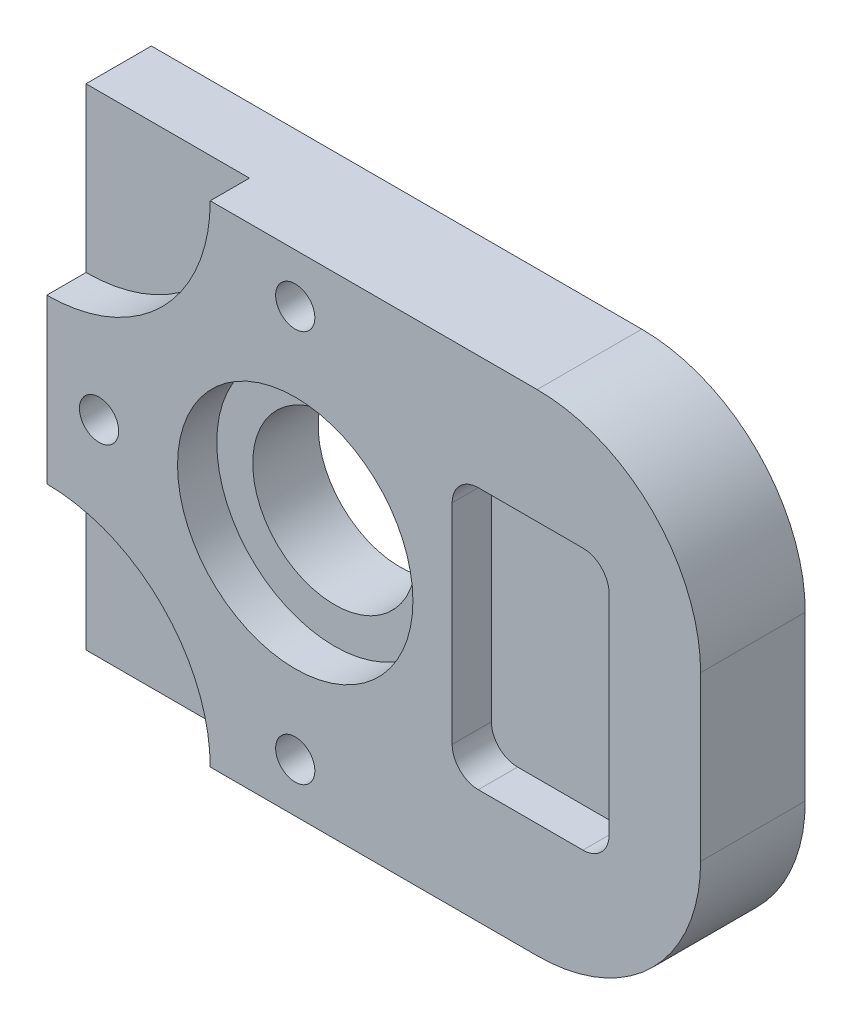
ISO-10303-21;
HEADER;
FILE_DESCRIPTION(('STEP AP214'),'2;1');
FILE_NAME('part.step','',(''),(''),'','','');
FILE_SCHEMA(('AUTOMOTIVE_DESIGN { 1 0 10303 214 1 1 1 1 }'));
ENDSEC;
DATA;
#1=APPLICATION_CONTEXT('core data for automotive mechanical design processes');
#2=APPLICATION_PROTOCOL_DEFINITION('international standard','automotive_design',2000,#1);
#3=PRODUCT_CONTEXT('',#1,'mechanical');
#4=PRODUCT('Part','Part','',(#3));
#5=PRODUCT_RELATED_PRODUCT_CATEGORY('part','',(#4));
#6=PRODUCT_DEFINITION_FORMATION('','',#4);
#7=PRODUCT_DEFINITION_CONTEXT('part definition',#1,'design');
#8=PRODUCT_DEFINITION('design','',#6,#7);
#9=PRODUCT_DEFINITION_SHAPE('','',#8);
#10=(LENGTH_UNIT() NAMED_UNIT(*) SI_UNIT(.MILLI.,.METRE.));
#11=(NAMED_UNIT(*) PLANE_ANGLE_UNIT() SI_UNIT($,.RADIAN.));
#12=(NAMED_UNIT(*) SI_UNIT($,.STERADIAN.) SOLID_ANGLE_UNIT());
#13=UNCERTAINTY_MEASURE_WITH_UNIT(LENGTH_MEASURE(1.E-05),#10,'distance_accuracy_value','');
#14=(GEOMETRIC_REPRESENTATION_CONTEXT(3) GLOBAL_UNCERTAINTY_ASSIGNED_CONTEXT((#13)) GLOBAL_UNIT_ASSIGNED_CONTEXT((#10,
#11,#12)) REPRESENTATION_CONTEXT('',''));
#15=CARTESIAN_POINT('',(0.,0.,0.));
#16=DIRECTION('',(0.,0.,1.));
#17=DIRECTION('',(1.,0.,0.));
#18=AXIS2_PLACEMENT_3D('',#15,#16,#17);
#19=CARTESIAN_POINT('',(38.,37.5,0.));
#20=DIRECTION('',(0.,0.,1.));
#21=DIRECTION('',(1.,0.,0.));
#22=AXIS2_PLACEMENT_3D('',#19,#20,#21);
#23=CYLINDRICAL_SURFACE('',#22,12.5);
#24=CARTESIAN_POINT('',(38.,37.5,0.));
#25=DIRECTION('',(0.,0.,1.));
#26=DIRECTION('',(1.,0.,0.));
#27=AXIS2_PLACEMENT_3D('',#24,#25,#26);
#28=CIRCLE('',#27,12.5);
#29=CARTESIAN_POINT('',(50.5,37.5,0.));
#30=VERTEX_POINT('',#29);
#31=EDGE_CURVE('E238',#30,#30,#28,.T.);
#32=ORIENTED_EDGE('',*,*,#31,.F.);
#33=EDGE_LOOP('',(#32));
#34=FACE_BOUND('',#33,.T.);
#35=CARTESIAN_POINT('',(38.,37.5,10.));
#36=DIRECTION('',(0.,0.,1.));
#37=DIRECTION('',(1.,0.,0.));
#38=AXIS2_PLACEMENT_3D('',#35,#36,#37);
#39=CIRCLE('',#38,12.5);
#40=CARTESIAN_POINT('',(50.5,37.5,10.));
#41=VERTEX_POINT('',#40);
#42=EDGE_CURVE('E237',#41,#41,#39,.F.);
#43=ORIENTED_EDGE('',*,*,#42,.F.);
#44=EDGE_LOOP('',(#43));
#45=FACE_BOUND('',#44,.T.);
#46=ADVANCED_FACE('F34',(#34,#45),#23,.F.);
#47=CARTESIAN_POINT('',(0.,75.,16.));
#48=DIRECTION('',(1.,0.,0.));
#49=DIRECTION('',(0.,0.,-1.));
#50=AXIS2_PLACEMENT_3D('',#47,#48,#49);
#51=PLANE('',#50);
#52=DIRECTION('',(0.,-1.,0.));
#53=VECTOR('',#52,1.);
#54=CARTESIAN_POINT('',(0.,75.,10.));
#55=LINE('',#54,#53);
#56=CARTESIAN_POINT('',(0.,25.,10.));
#57=VERTEX_POINT('',#56);
#58=CARTESIAN_POINT('',(0.,0.,10.));
#59=VERTEX_POINT('',#58);
#60=EDGE_CURVE('E163',#57,#59,#55,.T.);
#61=ORIENTED_EDGE('',*,*,#60,.F.);
#62=DIRECTION('',(0.,0.,1.));
#63=VECTOR('',#62,1.);
#64=CARTESIAN_POINT('',(0.,25.,10.));
#65=LINE('',#64,#63);
#66=CARTESIAN_POINT('',(0.,25.,16.));
#67=VERTEX_POINT('',#66);
#68=EDGE_CURVE('E168',#57,#67,#65,.T.);
#69=ORIENTED_EDGE('',*,*,#68,.T.);
#70=DIRECTION('',(0.,-1.,0.));
#71=VECTOR('',#70,1.);
#72=CARTESIAN_POINT('',(0.,75.,16.));
#73=LINE('',#72,#71);
#74=CARTESIAN_POINT('',(0.,50.,16.));
#75=VERTEX_POINT('',#74);
#76=EDGE_CURVE('E255',#75,#67,#73,.T.);
#77=ORIENTED_EDGE('',*,*,#76,.F.);
#78=DIRECTION('',(0.,0.,1.));
#79=VECTOR('',#78,1.);
#80=CARTESIAN_POINT('',(0.,50.,10.));
#81=LINE('',#80,#79);
#82=CARTESIAN_POINT('',(0.,50.,10.));
#83=VERTEX_POINT('',#82);
#84=EDGE_CURVE('E57',#75,#83,#81,.F.);
#85=ORIENTED_EDGE('',*,*,#84,.T.);
#86=DIRECTION('',(0.,-1.,0.));
#87=VECTOR('',#86,1.);
#88=CARTESIAN_POINT('',(0.,75.,10.));
#89=LINE('',#88,#87);
#90=CARTESIAN_POINT('',(0.,75.,10.));
#91=VERTEX_POINT('',#90);
#92=EDGE_CURVE('E187',#91,#83,#89,.T.);
#93=ORIENTED_EDGE('',*,*,#92,.F.);
#94=DIRECTION('',(0.,0.,-1.));
#95=VECTOR('',#94,1.);
#96=CARTESIAN_POINT('',(0.,75.,16.));
#97=LINE('',#96,#95);
#98=CARTESIAN_POINT('',(0.,75.,0.));
#99=VERTEX_POINT('',#98);
#100=EDGE_CURVE('E268',#91,#99,#97,.T.);
#101=ORIENTED_EDGE('',*,*,#100,.T.);
#102=DIRECTION('',(0.,-1.,0.));
#103=VECTOR('',#102,1.);
#104=CARTESIAN_POINT('',(0.,75.,0.));
#105=LINE('',#104,#103);
#106=CARTESIAN_POINT('',(0.,0.,0.));
#107=VERTEX_POINT('',#106);
#108=EDGE_CURVE('E241',#99,#107,#105,.T.);
#109=ORIENTED_EDGE('',*,*,#108,.T.);
#110=DIRECTION('',(0.,0.,-1.));
#111=VECTOR('',#110,1.);
#112=CARTESIAN_POINT('',(0.,0.,16.));
#113=LINE('',#112,#111);
#114=EDGE_CURVE('E282',#59,#107,#113,.T.);
#115=ORIENTED_EDGE('',*,*,#114,.F.);
#116=EDGE_LOOP('',(#61,#69,#77,#85,#93,#101,#109,#115));
#117=FACE_BOUND('',#116,.T.);
#118=ADVANCED_FACE('F36',(#117),#51,.F.);
#119=CARTESIAN_POINT('',(0.,0.,16.));
#120=DIRECTION('',(0.,1.,0.));
#121=DIRECTION('',(0.,0.,1.));
#122=AXIS2_PLACEMENT_3D('',#119,#120,#121);
#123=PLANE('',#122);
#124=DIRECTION('',(1.,0.,0.));
#125=VECTOR('',#124,1.);
#126=CARTESIAN_POINT('',(0.,0.,16.));
#127=LINE('',#126,#125);
#128=CARTESIAN_POINT('',(25.,0.,16.));
#129=VERTEX_POINT('',#128);
#130=CARTESIAN_POINT('',(75.,0.,16.));
#131=VERTEX_POINT('',#130);
#132=EDGE_CURVE('E174',#129,#131,#127,.T.);
#133=ORIENTED_EDGE('',*,*,#132,.F.);
#134=DIRECTION('',(0.,0.,1.));
#135=VECTOR('',#134,1.);
#136=CARTESIAN_POINT('',(25.,0.,10.));
#137=LINE('',#136,#135);
#138=CARTESIAN_POINT('',(25.,0.,10.));
#139=VERTEX_POINT('',#138);
#140=EDGE_CURVE('E49',#129,#139,#137,.F.);
#141=ORIENTED_EDGE('',*,*,#140,.T.);
#142=DIRECTION('',(1.,0.,0.));
#143=VECTOR('',#142,1.);
#144=CARTESIAN_POINT('',(0.,0.,10.));
#145=LINE('',#144,#143);
#146=EDGE_CURVE('E11',#59,#139,#145,.T.);
#147=ORIENTED_EDGE('',*,*,#146,.F.);
#148=ORIENTED_EDGE('',*,*,#114,.T.);
#149=DIRECTION('',(1.,0.,0.));
#150=VECTOR('',#149,1.);
#151=CARTESIAN_POINT('',(0.,0.,0.));
#152=LINE('',#151,#150);
#153=CARTESIAN_POINT('',(75.,0.,0.));
#154=VERTEX_POINT('',#153);
#155=EDGE_CURVE('E244',#107,#154,#152,.T.);
#156=ORIENTED_EDGE('',*,*,#155,.T.);
#157=DIRECTION('',(0.,0.,-1.));
#158=VECTOR('',#157,1.);
#159=CARTESIAN_POINT('',(75.,0.,16.));
#160=LINE('',#159,#158);
#161=EDGE_CURVE('E279',#131,#154,#160,.T.);
#162=ORIENTED_EDGE('',*,*,#161,.F.);
#163=EDGE_LOOP('',(#133,#141,#147,#148,#156,#162));
#164=FACE_BOUND('',#163,.T.);
#165=ADVANCED_FACE('F172',(#164),#123,.F.);
#166=CARTESIAN_POINT('',(75.,25.,16.));
#167=DIRECTION('',(0.,0.,-1.));
#168=DIRECTION('',(-1.,0.,0.));
#169=AXIS2_PLACEMENT_3D('',#166,#167,#168);
#170=CYLINDRICAL_SURFACE('',#169,25.);
#171=CARTESIAN_POINT('',(75.,25.,0.));
#172=DIRECTION('',(0.,0.,1.));
#173=DIRECTION('',(1.,0.,0.));
#174=AXIS2_PLACEMENT_3D('',#171,#172,#173);
#175=CIRCLE('',#174,25.);
#176=CARTESIAN_POINT('',(100.,25.,0.));
#177=VERTEX_POINT('',#176);
#178=EDGE_CURVE('E246',#154,#177,#175,.T.);
#179=ORIENTED_EDGE('',*,*,#178,.T.);
#180=DIRECTION('',(0.,0.,-1.));
#181=VECTOR('',#180,1.);
#182=CARTESIAN_POINT('',(100.,25.,16.));
#183=LINE('',#182,#181);
#184=CARTESIAN_POINT('',(100.,25.,16.));
#185=VERTEX_POINT('',#184);
#186=EDGE_CURVE('E276',#185,#177,#183,.T.);
#187=ORIENTED_EDGE('',*,*,#186,.F.);
#188=CARTESIAN_POINT('',(75.,25.,16.));
#189=DIRECTION('',(0.,0.,1.));
#190=DIRECTION('',(1.,0.,0.));
#191=AXIS2_PLACEMENT_3D('',#188,#189,#190);
#192=CIRCLE('',#191,25.);
#193=EDGE_CURVE('E259',#131,#185,#192,.T.);
#194=ORIENTED_EDGE('',*,*,#193,.F.);
#195=ORIENTED_EDGE('',*,*,#161,.T.);
#196=EDGE_LOOP('',(#179,#187,#194,#195));
#197=FACE_BOUND('',#196,.T.);
#198=ADVANCED_FACE('F343',(#197),#170,.T.);
#199=CARTESIAN_POINT('',(100.,50.,16.));
#200=DIRECTION('',(-1.,0.,0.));
#201=DIRECTION('',(0.,0.,1.));
#202=AXIS2_PLACEMENT_3D('',#199,#200,#201);
#203=PLANE('',#202);
#204=DIRECTION('',(0.,1.,0.));
#205=VECTOR('',#204,1.);
#206=CARTESIAN_POINT('',(100.,50.,0.));
#207=LINE('',#206,#205);
#208=CARTESIAN_POINT('',(100.,50.,0.));
#209=VERTEX_POINT('',#208);
#210=EDGE_CURVE('E248',#177,#209,#207,.T.);
#211=ORIENTED_EDGE('',*,*,#210,.T.);
#212=DIRECTION('',(0.,0.,-1.));
#213=VECTOR('',#212,1.);
#214=CARTESIAN_POINT('',(100.,50.,16.));
#215=LINE('',#214,#213);
#216=CARTESIAN_POINT('',(100.,50.,16.));
#217=VERTEX_POINT('',#216);
#218=EDGE_CURVE('E273',#217,#209,#215,.T.);
#219=ORIENTED_EDGE('',*,*,#218,.F.);
#220=DIRECTION('',(0.,1.,0.));
#221=VECTOR('',#220,1.);
#222=CARTESIAN_POINT('',(100.,50.,16.));
#223=LINE('',#222,#221);
#224=EDGE_CURVE('E261',#185,#217,#223,.T.);
#225=ORIENTED_EDGE('',*,*,#224,.F.);
#226=ORIENTED_EDGE('',*,*,#186,.T.);
#227=EDGE_LOOP('',(#211,#219,#225,#226));
#228=FACE_BOUND('',#227,.T.);
#229=ADVANCED_FACE('F348',(#228),#203,.F.);
#230=CARTESIAN_POINT('',(75.,50.,16.));
#231=DIRECTION('',(0.,0.,-1.));
#232=DIRECTION('',(-1.,0.,0.));
#233=AXIS2_PLACEMENT_3D('',#230,#231,#232);
#234=CYLINDRICAL_SURFACE('',#233,25.);
#235=CARTESIAN_POINT('',(75.,50.,0.));
#236=DIRECTION('',(0.,0.,1.));
#237=DIRECTION('',(-1.,0.,0.));
#238=AXIS2_PLACEMENT_3D('',#235,#236,#237);
#239=CIRCLE('',#238,25.);
#240=CARTESIAN_POINT('',(75.,75.,0.));
#241=VERTEX_POINT('',#240);
#242=EDGE_CURVE('E250',#209,#241,#239,.T.);
#243=ORIENTED_EDGE('',*,*,#242,.T.);
#244=DIRECTION('',(0.,0.,-1.));
#245=VECTOR('',#244,1.);
#246=CARTESIAN_POINT('',(75.,75.,16.));
#247=LINE('',#246,#245);
#248=CARTESIAN_POINT('',(75.,75.,16.));
#249=VERTEX_POINT('',#248);
#250=EDGE_CURVE('E270',#249,#241,#247,.T.);
#251=ORIENTED_EDGE('',*,*,#250,.F.);
#252=CARTESIAN_POINT('',(75.,50.,16.));
#253=DIRECTION('',(0.,0.,1.));
#254=DIRECTION('',(-1.,0.,0.));
#255=AXIS2_PLACEMENT_3D('',#252,#253,#254);
#256=CIRCLE('',#255,25.);
#257=EDGE_CURVE('E263',#217,#249,#256,.T.);
#258=ORIENTED_EDGE('',*,*,#257,.F.);
#259=ORIENTED_EDGE('',*,*,#218,.T.);
#260=EDGE_LOOP('',(#243,#251,#258,#259));
#261=FACE_BOUND('',#260,.T.);
#262=ADVANCED_FACE('F352',(#261),#234,.T.);
#263=CARTESIAN_POINT('',(0.,75.,16.));
#264=DIRECTION('',(0.,-1.,0.));
#265=DIRECTION('',(0.,0.,-1.));
#266=AXIS2_PLACEMENT_3D('',#263,#264,#265);
#267=PLANE('',#266);
#268=DIRECTION('',(-1.,0.,0.));
#269=VECTOR('',#268,1.);
#270=CARTESIAN_POINT('',(0.,75.,10.));
#271=LINE('',#270,#269);
#272=CARTESIAN_POINT('',(25.,75.,10.));
#273=VERTEX_POINT('',#272);
#274=EDGE_CURVE('E42',#273,#91,#271,.T.);
#275=ORIENTED_EDGE('',*,*,#274,.F.);
#276=DIRECTION('',(0.,0.,1.));
#277=VECTOR('',#276,1.);
#278=CARTESIAN_POINT('',(25.,75.,10.));
#279=LINE('',#278,#277);
#280=CARTESIAN_POINT('',(25.,75.,16.));
#281=VERTEX_POINT('',#280);
#282=EDGE_CURVE('E183',#273,#281,#279,.T.);
#283=ORIENTED_EDGE('',*,*,#282,.T.);
#284=DIRECTION('',(-1.,0.,0.));
#285=VECTOR('',#284,1.);
#286=CARTESIAN_POINT('',(0.,75.,16.));
#287=LINE('',#286,#285);
#288=EDGE_CURVE('E265',#249,#281,#287,.T.);
#289=ORIENTED_EDGE('',*,*,#288,.F.);
#290=ORIENTED_EDGE('',*,*,#250,.T.);
#291=DIRECTION('',(-1.,0.,0.));
#292=VECTOR('',#291,1.);
#293=CARTESIAN_POINT('',(0.,75.,0.));
#294=LINE('',#293,#292);
#295=EDGE_CURVE('E252',#241,#99,#294,.T.);
#296=ORIENTED_EDGE('',*,*,#295,.T.);
#297=ORIENTED_EDGE('',*,*,#100,.F.);
#298=EDGE_LOOP('',(#275,#283,#289,#290,#296,#297));
#299=FACE_BOUND('',#298,.T.);
#300=ADVANCED_FACE('F331',(#299),#267,.F.);
#301=CARTESIAN_POINT('',(75.,25.,16.));
#302=DIRECTION('',(0.,0.,1.));
#303=DIRECTION('',(1.,0.,0.));
#304=AXIS2_PLACEMENT_3D('',#301,#302,#303);
#305=PLANE('',#304);
#306=CARTESIAN_POINT('',(0.,0.,16.));
#307=DIRECTION('',(0.,0.,1.));
#308=DIRECTION('',(1.,0.,0.));
#309=AXIS2_PLACEMENT_3D('',#306,#307,#308);
#310=CIRCLE('',#309,25.);
#311=EDGE_CURVE('E169',#129,#67,#310,.T.);
#312=ORIENTED_EDGE('',*,*,#311,.F.);
#313=ORIENTED_EDGE('',*,*,#132,.T.);
#314=ORIENTED_EDGE('',*,*,#193,.T.);
#315=ORIENTED_EDGE('',*,*,#224,.T.);
#316=ORIENTED_EDGE('',*,*,#257,.T.);
#317=ORIENTED_EDGE('',*,*,#288,.T.);
#318=CARTESIAN_POINT('',(0.,75.,16.));
#319=DIRECTION('',(0.,0.,1.));
#320=DIRECTION('',(1.,0.,0.));
#321=AXIS2_PLACEMENT_3D('',#318,#319,#320);
#322=CIRCLE('',#321,25.);
#323=EDGE_CURVE('E322',#75,#281,#322,.T.);
#324=ORIENTED_EDGE('',*,*,#323,.F.);
#325=ORIENTED_EDGE('',*,*,#76,.T.);
#326=EDGE_LOOP('',(#312,#313,#314,#315,#316,#317,#324,#325));
#327=FACE_BOUND('',#326,.T.);
#328=CARTESIAN_POINT('',(38.,67.5,16.));
#329=DIRECTION('',(0.,0.,1.));
#330=DIRECTION('',(1.,0.,0.));
#331=AXIS2_PLACEMENT_3D('',#328,#329,#330);
#332=CIRCLE('',#331,3.00000000000002);
#333=CARTESIAN_POINT('',(41.,67.5,16.));
#334=VERTEX_POINT('',#333);
#335=EDGE_CURVE('E189',#334,#334,#332,.T.);
#336=ORIENTED_EDGE('',*,*,#335,.F.);
#337=EDGE_LOOP('',(#336));
#338=FACE_BOUND('',#337,.T.);
#339=CARTESIAN_POINT('',(8.00000000000001,37.5,16.));
#340=DIRECTION('',(0.,0.,1.));
#341=DIRECTION('',(1.,0.,0.));
#342=AXIS2_PLACEMENT_3D('',#339,#340,#341);
#343=CIRCLE('',#342,3.00000000000001);
#344=CARTESIAN_POINT('',(11.,37.5,16.));
#345=VERTEX_POINT('',#344);
#346=EDGE_CURVE('E195',#345,#345,#343,.T.);
#347=ORIENTED_EDGE('',*,*,#346,.F.);
#348=EDGE_LOOP('',(#347));
#349=FACE_BOUND('',#348,.T.);
#350=CARTESIAN_POINT('',(38.,7.49999999999999,16.));
#351=DIRECTION('',(0.,0.,1.));
#352=DIRECTION('',(1.,0.,0.));
#353=AXIS2_PLACEMENT_3D('',#350,#351,#352);
#354=CIRCLE('',#353,3.00000000000002);
#355=CARTESIAN_POINT('',(41.,7.49999999999999,16.));
#356=VERTEX_POINT('',#355);
#357=EDGE_CURVE('E201',#356,#356,#354,.T.);
#358=ORIENTED_EDGE('',*,*,#357,.F.);
#359=EDGE_LOOP('',(#358));
#360=FACE_BOUND('',#359,.T.);
#361=DIRECTION('',(0.,-1.,0.));
#362=VECTOR('',#361,1.);
#363=CARTESIAN_POINT('',(62.,57.5,16.));
#364=LINE('',#363,#362);
#365=CARTESIAN_POINT('',(62.,53.5,16.));
#366=VERTEX_POINT('',#365);
#367=CARTESIAN_POINT('',(62.,21.5,16.));
#368=VERTEX_POINT('',#367);
#369=EDGE_CURVE('E207',#366,#368,#364,.T.);
#370=ORIENTED_EDGE('',*,*,#369,.F.);
#371=CARTESIAN_POINT('',(66.,53.5,16.));
#372=DIRECTION('',(0.,0.,1.));
#373=DIRECTION('',(1.,0.,0.));
#374=AXIS2_PLACEMENT_3D('',#371,#372,#373);
#375=CIRCLE('',#374,4.);
#376=CARTESIAN_POINT('',(66.,57.5,16.));
#377=VERTEX_POINT('',#376);
#378=EDGE_CURVE('E320',#366,#377,#375,.F.);
#379=ORIENTED_EDGE('',*,*,#378,.T.);
#380=DIRECTION('',(-1.,0.,0.));
#381=VECTOR('',#380,1.);
#382=CARTESIAN_POINT('',(62.,57.5,16.));
#383=LINE('',#382,#381);
#384=CARTESIAN_POINT('',(82.,57.5,16.));
#385=VERTEX_POINT('',#384);
#386=EDGE_CURVE('E216',#385,#377,#383,.T.);
#387=ORIENTED_EDGE('',*,*,#386,.F.);
#388=CARTESIAN_POINT('',(82.,53.5,16.));
#389=DIRECTION('',(0.,0.,1.));
#390=DIRECTION('',(1.,0.,0.));
#391=AXIS2_PLACEMENT_3D('',#388,#389,#390);
#392=CIRCLE('',#391,4.);
#393=CARTESIAN_POINT('',(86.,53.5,16.));
#394=VERTEX_POINT('',#393);
#395=EDGE_CURVE('E318',#385,#394,#392,.F.);
#396=ORIENTED_EDGE('',*,*,#395,.T.);
#397=DIRECTION('',(0.,1.,0.));
#398=VECTOR('',#397,1.);
#399=CARTESIAN_POINT('',(86.,57.5,16.));
#400=LINE('',#399,#398);
#401=CARTESIAN_POINT('',(86.,21.5,16.));
#402=VERTEX_POINT('',#401);
#403=EDGE_CURVE('E213',#402,#394,#400,.T.);
#404=ORIENTED_EDGE('',*,*,#403,.F.);
#405=CARTESIAN_POINT('',(82.,21.5,16.));
#406=DIRECTION('',(0.,0.,1.));
#407=DIRECTION('',(1.,0.,0.));
#408=AXIS2_PLACEMENT_3D('',#405,#406,#407);
#409=CIRCLE('',#408,4.);
#410=CARTESIAN_POINT('',(82.,17.5,16.));
#411=VERTEX_POINT('',#410);
#412=EDGE_CURVE('E316',#402,#411,#409,.F.);
#413=ORIENTED_EDGE('',*,*,#412,.T.);
#414=DIRECTION('',(1.,0.,0.));
#415=VECTOR('',#414,1.);
#416=CARTESIAN_POINT('',(62.,17.5,16.));
#417=LINE('',#416,#415);
#418=CARTESIAN_POINT('',(66.,17.5,16.));
#419=VERTEX_POINT('',#418);
#420=EDGE_CURVE('E210',#419,#411,#417,.T.);
#421=ORIENTED_EDGE('',*,*,#420,.F.);
#422=CARTESIAN_POINT('',(66.,21.5,16.));
#423=DIRECTION('',(0.,0.,1.));
#424=DIRECTION('',(1.,0.,0.));
#425=AXIS2_PLACEMENT_3D('',#422,#423,#424);
#426=CIRCLE('',#425,4.);
#427=EDGE_CURVE('E314',#419,#368,#426,.F.);
#428=ORIENTED_EDGE('',*,*,#427,.T.);
#429=EDGE_LOOP('',(#370,#379,#387,#396,#404,#413,#421,#428));
#430=FACE_BOUND('',#429,.T.);
#431=CARTESIAN_POINT('',(38.,37.5,16.));
#432=DIRECTION('',(0.,0.,1.));
#433=DIRECTION('',(1.,0.,0.));
#434=AXIS2_PLACEMENT_3D('',#431,#432,#433);
#435=CIRCLE('',#434,18.);
#436=CARTESIAN_POINT('',(56.,37.5,16.));
#437=VERTEX_POINT('',#436);
#438=EDGE_CURVE('E231',#437,#437,#435,.T.);
#439=ORIENTED_EDGE('',*,*,#438,.F.);
#440=EDGE_LOOP('',(#439));
#441=FACE_BOUND('',#440,.T.);
#442=ADVANCED_FACE('F354',(#327,#338,#349,#360,#430,#441),#305,.T.);
#443=CARTESIAN_POINT('',(75.,25.,0.));
#444=DIRECTION('',(0.,0.,1.));
#445=DIRECTION('',(1.,0.,0.));
#446=AXIS2_PLACEMENT_3D('',#443,#444,#445);
#447=PLANE('',#446);
#448=CARTESIAN_POINT('',(38.,67.5,0.));
#449=DIRECTION('',(0.,0.,1.));
#450=DIRECTION('',(1.,0.,0.));
#451=AXIS2_PLACEMENT_3D('',#448,#449,#450);
#452=CIRCLE('',#451,3.00000000000001);
#453=CARTESIAN_POINT('',(41.,67.5,0.));
#454=VERTEX_POINT('',#453);
#455=EDGE_CURVE('E192',#454,#454,#452,.T.);
#456=ORIENTED_EDGE('',*,*,#455,.T.);
#457=EDGE_LOOP('',(#456));
#458=FACE_BOUND('',#457,.T.);
#459=CARTESIAN_POINT('',(8.00000000000001,37.5,0.));
#460=DIRECTION('',(0.,0.,1.));
#461=DIRECTION('',(1.,0.,0.));
#462=AXIS2_PLACEMENT_3D('',#459,#460,#461);
#463=CIRCLE('',#462,3.00000000000001);
#464=CARTESIAN_POINT('',(11.,37.5,0.));
#465=VERTEX_POINT('',#464);
#466=EDGE_CURVE('E198',#465,#465,#463,.T.);
#467=ORIENTED_EDGE('',*,*,#466,.T.);
#468=EDGE_LOOP('',(#467));
#469=FACE_BOUND('',#468,.T.);
#470=CARTESIAN_POINT('',(38.,7.49999999999999,0.));
#471=DIRECTION('',(0.,0.,1.));
#472=DIRECTION('',(1.,0.,0.));
#473=AXIS2_PLACEMENT_3D('',#470,#471,#472);
#474=CIRCLE('',#473,3.00000000000001);
#475=CARTESIAN_POINT('',(41.,7.49999999999999,0.));
#476=VERTEX_POINT('',#475);
#477=EDGE_CURVE('E204',#476,#476,#474,.T.);
#478=ORIENTED_EDGE('',*,*,#477,.T.);
#479=EDGE_LOOP('',(#478));
#480=FACE_BOUND('',#479,.T.);
#481=ORIENTED_EDGE('',*,*,#31,.T.);
#482=EDGE_LOOP('',(#481));
#483=FACE_BOUND('',#482,.T.);
#484=ORIENTED_EDGE('',*,*,#108,.F.);
#485=ORIENTED_EDGE('',*,*,#295,.F.);
#486=ORIENTED_EDGE('',*,*,#242,.F.);
#487=ORIENTED_EDGE('',*,*,#210,.F.);
#488=ORIENTED_EDGE('',*,*,#178,.F.);
#489=ORIENTED_EDGE('',*,*,#155,.F.);
#490=EDGE_LOOP('',(#484,#485,#486,#487,#488,#489));
#491=FACE_BOUND('',#490,.T.);
#492=ADVANCED_FACE('F339',(#458,#469,#480,#483,#491),#447,.F.);
#493=CARTESIAN_POINT('',(38.,37.5,10.));
#494=DIRECTION('',(0.,0.,1.));
#495=DIRECTION('',(1.,0.,0.));
#496=AXIS2_PLACEMENT_3D('',#493,#494,#495);
#497=PLANE('',#496);
#498=CARTESIAN_POINT('',(38.,37.5,10.));
#499=DIRECTION('',(0.,0.,1.));
#500=DIRECTION('',(1.,0.,0.));
#501=AXIS2_PLACEMENT_3D('',#498,#499,#500);
#502=CIRCLE('',#501,18.);
#503=CARTESIAN_POINT('',(56.,37.5,10.));
#504=VERTEX_POINT('',#503);
#505=EDGE_CURVE('E234',#504,#504,#502,.T.);
#506=ORIENTED_EDGE('',*,*,#505,.T.);
#507=EDGE_LOOP('',(#506));
#508=FACE_BOUND('',#507,.T.);
#509=ORIENTED_EDGE('',*,*,#42,.T.);
#510=EDGE_LOOP('',(#509));
#511=FACE_BOUND('',#510,.T.);
#512=ADVANCED_FACE('F381',(#508,#511),#497,.T.);
#513=CARTESIAN_POINT('',(38.,37.5,10.));
#514=DIRECTION('',(0.,0.,1.));
#515=DIRECTION('',(1.,0.,0.));
#516=AXIS2_PLACEMENT_3D('',#513,#514,#515);
#517=CYLINDRICAL_SURFACE('',#516,18.);
#518=ORIENTED_EDGE('',*,*,#505,.F.);
#519=EDGE_LOOP('',(#518));
#520=FACE_BOUND('',#519,.T.);
#521=ORIENTED_EDGE('',*,*,#438,.T.);
#522=EDGE_LOOP('',(#521));
#523=FACE_BOUND('',#522,.T.);
#524=ADVANCED_FACE('F377',(#520,#523),#517,.F.);
#525=CARTESIAN_POINT('',(62.,57.5,10.));
#526=DIRECTION('',(-1.,0.,0.));
#527=DIRECTION('',(0.,0.,1.));
#528=AXIS2_PLACEMENT_3D('',#525,#526,#527);
#529=PLANE('',#528);
#530=ORIENTED_EDGE('',*,*,#369,.T.);
#531=DIRECTION('',(0.,0.,1.));
#532=VECTOR('',#531,1.);
#533=CARTESIAN_POINT('',(62.,21.5,10.));
#534=LINE('',#533,#532);
#535=CARTESIAN_POINT('',(62.,21.5,10.));
#536=VERTEX_POINT('',#535);
#537=EDGE_CURVE('E294',#368,#536,#534,.F.);
#538=ORIENTED_EDGE('',*,*,#537,.T.);
#539=DIRECTION('',(0.,-1.,0.));
#540=VECTOR('',#539,1.);
#541=CARTESIAN_POINT('',(62.,57.5,10.));
#542=LINE('',#541,#540);
#543=CARTESIAN_POINT('',(62.,53.5,10.));
#544=VERTEX_POINT('',#543);
#545=EDGE_CURVE('E219',#544,#536,#542,.T.);
#546=ORIENTED_EDGE('',*,*,#545,.F.);
#547=DIRECTION('',(0.,0.,1.));
#548=VECTOR('',#547,1.);
#549=CARTESIAN_POINT('',(62.,53.5,16.));
#550=LINE('',#549,#548);
#551=EDGE_CURVE('E291',#544,#366,#550,.T.);
#552=ORIENTED_EDGE('',*,*,#551,.T.);
#553=EDGE_LOOP('',(#530,#538,#546,#552));
#554=FACE_BOUND('',#553,.T.);
#555=ADVANCED_FACE('F436',(#554),#529,.F.);
#556=CARTESIAN_POINT('',(62.,57.5,10.));
#557=DIRECTION('',(0.,1.,0.));
#558=DIRECTION('',(0.,0.,1.));
#559=AXIS2_PLACEMENT_3D('',#556,#557,#558);
#560=PLANE('',#559);
#561=DIRECTION('',(-1.,0.,0.));
#562=VECTOR('',#561,1.);
#563=CARTESIAN_POINT('',(62.,57.5,10.));
#564=LINE('',#563,#562);
#565=CARTESIAN_POINT('',(82.,57.5,10.));
#566=VERTEX_POINT('',#565);
#567=CARTESIAN_POINT('',(66.,57.5,10.));
#568=VERTEX_POINT('',#567);
#569=EDGE_CURVE('E228',#566,#568,#564,.T.);
#570=ORIENTED_EDGE('',*,*,#569,.F.);
#571=DIRECTION('',(0.,0.,1.));
#572=VECTOR('',#571,1.);
#573=CARTESIAN_POINT('',(82.,57.5,16.));
#574=LINE('',#573,#572);
#575=EDGE_CURVE('E311',#566,#385,#574,.T.);
#576=ORIENTED_EDGE('',*,*,#575,.T.);
#577=ORIENTED_EDGE('',*,*,#386,.T.);
#578=DIRECTION('',(0.,0.,1.));
#579=VECTOR('',#578,1.);
#580=CARTESIAN_POINT('',(66.,57.5,10.));
#581=LINE('',#580,#579);
#582=EDGE_CURVE('E309',#377,#568,#581,.F.);
#583=ORIENTED_EDGE('',*,*,#582,.T.);
#584=EDGE_LOOP('',(#570,#576,#577,#583));
#585=FACE_BOUND('',#584,.T.);
#586=ADVANCED_FACE('F443',(#585),#560,.F.);
#587=CARTESIAN_POINT('',(86.,57.5,10.));
#588=DIRECTION('',(1.,0.,0.));
#589=DIRECTION('',(0.,0.,-1.));
#590=AXIS2_PLACEMENT_3D('',#587,#588,#589);
#591=PLANE('',#590);
#592=DIRECTION('',(0.,1.,0.));
#593=VECTOR('',#592,1.);
#594=CARTESIAN_POINT('',(86.,57.5,10.));
#595=LINE('',#594,#593);
#596=CARTESIAN_POINT('',(86.,21.5,10.));
#597=VERTEX_POINT('',#596);
#598=CARTESIAN_POINT('',(86.,53.5,10.));
#599=VERTEX_POINT('',#598);
#600=EDGE_CURVE('E225',#597,#599,#595,.T.);
#601=ORIENTED_EDGE('',*,*,#600,.F.);
#602=DIRECTION('',(0.,0.,1.));
#603=VECTOR('',#602,1.);
#604=CARTESIAN_POINT('',(86.,21.5,16.));
#605=LINE('',#604,#603);
#606=EDGE_CURVE('E306',#597,#402,#605,.T.);
#607=ORIENTED_EDGE('',*,*,#606,.T.);
#608=ORIENTED_EDGE('',*,*,#403,.T.);
#609=DIRECTION('',(0.,0.,1.));
#610=VECTOR('',#609,1.);
#611=CARTESIAN_POINT('',(86.,53.5,10.));
#612=LINE('',#611,#610);
#613=EDGE_CURVE('E304',#394,#599,#612,.F.);
#614=ORIENTED_EDGE('',*,*,#613,.T.);
#615=EDGE_LOOP('',(#601,#607,#608,#614));
#616=FACE_BOUND('',#615,.T.);
#617=ADVANCED_FACE('F451',(#616),#591,.F.);
#618=CARTESIAN_POINT('',(62.,17.5,10.));
#619=DIRECTION('',(0.,-1.,0.));
#620=DIRECTION('',(0.,0.,-1.));
#621=AXIS2_PLACEMENT_3D('',#618,#619,#620);
#622=PLANE('',#621);
#623=DIRECTION('',(1.,0.,0.));
#624=VECTOR('',#623,1.);
#625=CARTESIAN_POINT('',(62.,17.5,10.));
#626=LINE('',#625,#624);
#627=CARTESIAN_POINT('',(66.,17.5,10.));
#628=VERTEX_POINT('',#627);
#629=CARTESIAN_POINT('',(82.,17.5,10.));
#630=VERTEX_POINT('',#629);
#631=EDGE_CURVE('E222',#628,#630,#626,.T.);
#632=ORIENTED_EDGE('',*,*,#631,.F.);
#633=DIRECTION('',(0.,0.,1.));
#634=VECTOR('',#633,1.);
#635=CARTESIAN_POINT('',(66.,17.5,16.));
#636=LINE('',#635,#634);
#637=EDGE_CURVE('E288',#628,#419,#636,.T.);
#638=ORIENTED_EDGE('',*,*,#637,.T.);
#639=ORIENTED_EDGE('',*,*,#420,.T.);
#640=DIRECTION('',(0.,0.,1.));
#641=VECTOR('',#640,1.);
#642=CARTESIAN_POINT('',(82.,17.5,10.));
#643=LINE('',#642,#641);
#644=EDGE_CURVE('E284',#411,#630,#643,.F.);
#645=ORIENTED_EDGE('',*,*,#644,.T.);
#646=EDGE_LOOP('',(#632,#638,#639,#645));
#647=FACE_BOUND('',#646,.T.);
#648=ADVANCED_FACE('F459',(#647),#622,.F.);
#649=CARTESIAN_POINT('',(62.,17.5,10.));
#650=DIRECTION('',(0.,0.,1.));
#651=DIRECTION('',(1.,0.,0.));
#652=AXIS2_PLACEMENT_3D('',#649,#650,#651);
#653=PLANE('',#652);
#654=ORIENTED_EDGE('',*,*,#545,.T.);
#655=CARTESIAN_POINT('',(66.,21.5,10.));
#656=DIRECTION('',(0.,0.,1.));
#657=DIRECTION('',(1.,0.,0.));
#658=AXIS2_PLACEMENT_3D('',#655,#656,#657);
#659=CIRCLE('',#658,4.);
#660=EDGE_CURVE('E302',#536,#628,#659,.T.);
#661=ORIENTED_EDGE('',*,*,#660,.T.);
#662=ORIENTED_EDGE('',*,*,#631,.T.);
#663=CARTESIAN_POINT('',(82.,21.5,10.));
#664=DIRECTION('',(0.,0.,1.));
#665=DIRECTION('',(1.,0.,0.));
#666=AXIS2_PLACEMENT_3D('',#663,#664,#665);
#667=CIRCLE('',#666,4.);
#668=EDGE_CURVE('E300',#630,#597,#667,.T.);
#669=ORIENTED_EDGE('',*,*,#668,.T.);
#670=ORIENTED_EDGE('',*,*,#600,.T.);
#671=CARTESIAN_POINT('',(82.,53.5,10.));
#672=DIRECTION('',(0.,0.,1.));
#673=DIRECTION('',(1.,0.,0.));
#674=AXIS2_PLACEMENT_3D('',#671,#672,#673);
#675=CIRCLE('',#674,4.);
#676=EDGE_CURVE('E298',#599,#566,#675,.T.);
#677=ORIENTED_EDGE('',*,*,#676,.T.);
#678=ORIENTED_EDGE('',*,*,#569,.T.);
#679=CARTESIAN_POINT('',(66.,53.5,10.));
#680=DIRECTION('',(0.,0.,1.));
#681=DIRECTION('',(1.,0.,0.));
#682=AXIS2_PLACEMENT_3D('',#679,#680,#681);
#683=CIRCLE('',#682,4.);
#684=EDGE_CURVE('E296',#568,#544,#683,.T.);
#685=ORIENTED_EDGE('',*,*,#684,.T.);
#686=EDGE_LOOP('',(#654,#661,#662,#669,#670,#677,#678,#685));
#687=FACE_BOUND('',#686,.T.);
#688=ADVANCED_FACE('F467',(#687),#653,.T.);
#689=CARTESIAN_POINT('',(66.,21.5,10.));
#690=DIRECTION('',(0.,0.,-1.));
#691=DIRECTION('',(-1.,0.,0.));
#692=AXIS2_PLACEMENT_3D('',#689,#690,#691);
#693=CYLINDRICAL_SURFACE('',#692,4.);
#694=ORIENTED_EDGE('',*,*,#660,.F.);
#695=ORIENTED_EDGE('',*,*,#537,.F.);
#696=ORIENTED_EDGE('',*,*,#427,.F.);
#697=ORIENTED_EDGE('',*,*,#637,.F.);
#698=EDGE_LOOP('',(#694,#695,#696,#697));
#699=FACE_BOUND('',#698,.T.);
#700=ADVANCED_FACE('F475',(#699),#693,.F.);
#701=CARTESIAN_POINT('',(82.,21.5,10.));
#702=DIRECTION('',(0.,0.,-1.));
#703=DIRECTION('',(-1.,0.,0.));
#704=AXIS2_PLACEMENT_3D('',#701,#702,#703);
#705=CYLINDRICAL_SURFACE('',#704,4.);
#706=ORIENTED_EDGE('',*,*,#668,.F.);
#707=ORIENTED_EDGE('',*,*,#644,.F.);
#708=ORIENTED_EDGE('',*,*,#412,.F.);
#709=ORIENTED_EDGE('',*,*,#606,.F.);
#710=EDGE_LOOP('',(#706,#707,#708,#709));
#711=FACE_BOUND('',#710,.T.);
#712=ADVANCED_FACE('F483',(#711),#705,.F.);
#713=CARTESIAN_POINT('',(82.,53.5,10.));
#714=DIRECTION('',(0.,0.,-1.));
#715=DIRECTION('',(-1.,0.,0.));
#716=AXIS2_PLACEMENT_3D('',#713,#714,#715);
#717=CYLINDRICAL_SURFACE('',#716,4.);
#718=ORIENTED_EDGE('',*,*,#676,.F.);
#719=ORIENTED_EDGE('',*,*,#613,.F.);
#720=ORIENTED_EDGE('',*,*,#395,.F.);
#721=ORIENTED_EDGE('',*,*,#575,.F.);
#722=EDGE_LOOP('',(#718,#719,#720,#721));
#723=FACE_BOUND('',#722,.T.);
#724=ADVANCED_FACE('F491',(#723),#717,.F.);
#725=CARTESIAN_POINT('',(66.,53.5,10.));
#726=DIRECTION('',(0.,0.,-1.));
#727=DIRECTION('',(-1.,0.,0.));
#728=AXIS2_PLACEMENT_3D('',#725,#726,#727);
#729=CYLINDRICAL_SURFACE('',#728,4.);
#730=ORIENTED_EDGE('',*,*,#684,.F.);
#731=ORIENTED_EDGE('',*,*,#582,.F.);
#732=ORIENTED_EDGE('',*,*,#378,.F.);
#733=ORIENTED_EDGE('',*,*,#551,.F.);
#734=EDGE_LOOP('',(#730,#731,#732,#733));
#735=FACE_BOUND('',#734,.T.);
#736=ADVANCED_FACE('F499',(#735),#729,.F.);
#737=CARTESIAN_POINT('',(38.,7.49999999999999,16.));
#738=DIRECTION('',(0.,0.,1.));
#739=DIRECTION('',(1.,0.,0.));
#740=AXIS2_PLACEMENT_3D('',#737,#738,#739);
#741=CYLINDRICAL_SURFACE('',#740,3.00000000000001);
#742=ORIENTED_EDGE('',*,*,#477,.F.);
#743=EDGE_LOOP('',(#742));
#744=FACE_BOUND('',#743,.T.);
#745=ORIENTED_EDGE('',*,*,#357,.T.);
#746=EDGE_LOOP('',(#745));
#747=FACE_BOUND('',#746,.T.);
#748=ADVANCED_FACE('F506',(#744,#747),#741,.F.);
#749=CARTESIAN_POINT('',(8.00000000000001,37.5,16.));
#750=DIRECTION('',(0.,0.,1.));
#751=DIRECTION('',(1.,0.,0.));
#752=AXIS2_PLACEMENT_3D('',#749,#750,#751);
#753=CYLINDRICAL_SURFACE('',#752,3.00000000000001);
#754=ORIENTED_EDGE('',*,*,#466,.F.);
#755=EDGE_LOOP('',(#754));
#756=FACE_BOUND('',#755,.T.);
#757=ORIENTED_EDGE('',*,*,#346,.T.);
#758=EDGE_LOOP('',(#757));
#759=FACE_BOUND('',#758,.T.);
#760=ADVANCED_FACE('F513',(#756,#759),#753,.F.);
#761=CARTESIAN_POINT('',(38.,67.5,16.));
#762=DIRECTION('',(0.,0.,1.));
#763=DIRECTION('',(1.,0.,0.));
#764=AXIS2_PLACEMENT_3D('',#761,#762,#763);
#765=CYLINDRICAL_SURFACE('',#764,3.00000000000001);
#766=ORIENTED_EDGE('',*,*,#455,.F.);
#767=EDGE_LOOP('',(#766));
#768=FACE_BOUND('',#767,.T.);
#769=ORIENTED_EDGE('',*,*,#335,.T.);
#770=EDGE_LOOP('',(#769));
#771=FACE_BOUND('',#770,.T.);
#772=ADVANCED_FACE('F364',(#768,#771),#765,.F.);
#773=CARTESIAN_POINT('',(0.,75.,10.));
#774=DIRECTION('',(0.,0.,1.));
#775=DIRECTION('',(1.,0.,0.));
#776=AXIS2_PLACEMENT_3D('',#773,#774,#775);
#777=PLANE('',#776);
#778=ORIENTED_EDGE('',*,*,#92,.T.);
#779=CARTESIAN_POINT('',(0.,75.,10.));
#780=DIRECTION('',(0.,0.,1.));
#781=DIRECTION('',(1.,0.,0.));
#782=AXIS2_PLACEMENT_3D('',#779,#780,#781);
#783=CIRCLE('',#782,25.);
#784=EDGE_CURVE('E180',#83,#273,#783,.T.);
#785=ORIENTED_EDGE('',*,*,#784,.T.);
#786=ORIENTED_EDGE('',*,*,#274,.T.);
#787=EDGE_LOOP('',(#778,#785,#786));
#788=FACE_BOUND('',#787,.T.);
#789=ADVANCED_FACE('F326',(#788),#777,.T.);
#790=CARTESIAN_POINT('',(0.,75.,10.));
#791=DIRECTION('',(0.,0.,1.));
#792=DIRECTION('',(1.,0.,0.));
#793=AXIS2_PLACEMENT_3D('',#790,#791,#792);
#794=CYLINDRICAL_SURFACE('',#793,25.);
#795=ORIENTED_EDGE('',*,*,#323,.T.);
#796=ORIENTED_EDGE('',*,*,#282,.F.);
#797=ORIENTED_EDGE('',*,*,#784,.F.);
#798=ORIENTED_EDGE('',*,*,#84,.F.);
#799=EDGE_LOOP('',(#795,#796,#797,#798));
#800=FACE_BOUND('',#799,.T.);
#801=ADVANCED_FACE('F356',(#800),#794,.F.);
#802=CARTESIAN_POINT('',(0.,0.,10.));
#803=DIRECTION('',(0.,0.,1.));
#804=DIRECTION('',(1.,0.,0.));
#805=AXIS2_PLACEMENT_3D('',#802,#803,#804);
#806=PLANE('',#805);
#807=ORIENTED_EDGE('',*,*,#60,.T.);
#808=ORIENTED_EDGE('',*,*,#146,.T.);
#809=CARTESIAN_POINT('',(0.,0.,10.));
#810=DIRECTION('',(0.,0.,1.));
#811=DIRECTION('',(1.,0.,0.));
#812=AXIS2_PLACEMENT_3D('',#809,#810,#811);
#813=CIRCLE('',#812,25.);
#814=EDGE_CURVE('E161',#139,#57,#813,.T.);
#815=ORIENTED_EDGE('',*,*,#814,.T.);
#816=EDGE_LOOP('',(#807,#808,#815));
#817=FACE_BOUND('',#816,.T.);
#818=ADVANCED_FACE('F160',(#817),#806,.T.);
#819=CARTESIAN_POINT('',(0.,0.,10.));
#820=DIRECTION('',(0.,0.,1.));
#821=DIRECTION('',(1.,0.,0.));
#822=AXIS2_PLACEMENT_3D('',#819,#820,#821);
#823=CYLINDRICAL_SURFACE('',#822,25.);
#824=ORIENTED_EDGE('',*,*,#814,.F.);
#825=ORIENTED_EDGE('',*,*,#140,.F.);
#826=ORIENTED_EDGE('',*,*,#311,.T.);
#827=ORIENTED_EDGE('',*,*,#68,.F.);
#828=EDGE_LOOP('',(#824,#825,#826,#827));
#829=FACE_BOUND('',#828,.T.);
#830=ADVANCED_FACE('F166',(#829),#823,.F.);
#831=CLOSED_SHELL('',(#46,#118,#165,#198,#229,#262,#300,#442,#492,#512,#524,#555,#586,#617,#648,
#688,#700,#712,#724,#736,#748,#760,#772,#789,#801,#818,#830));
#832=MANIFOLD_SOLID_BREP('B2',#831);
#833=ADVANCED_BREP_SHAPE_REPRESENTATION('',(#18,#832),#14);
#834=SHAPE_DEFINITION_REPRESENTATION(#9,#833);
ENDSEC;
END-ISO-10303-21;
